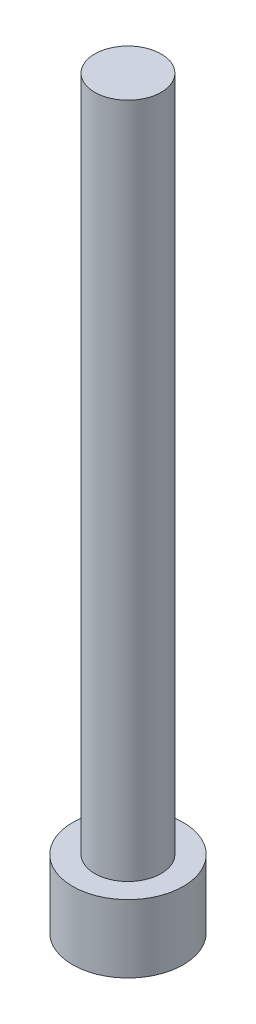
ISO-10303-21;
HEADER;
FILE_DESCRIPTION(('STEP AP214'),'2;1');
FILE_NAME('part.step','',(''),(''),'','','');
FILE_SCHEMA(('AUTOMOTIVE_DESIGN { 1 0 10303 214 1 1 1 1 }'));
ENDSEC;
DATA;
#1=APPLICATION_CONTEXT('core data for automotive mechanical design processes');
#2=APPLICATION_PROTOCOL_DEFINITION('international standard','automotive_design',2000,#1);
#3=PRODUCT_CONTEXT('',#1,'mechanical');
#4=PRODUCT('Part','Part','',(#3));
#5=PRODUCT_RELATED_PRODUCT_CATEGORY('part','',(#4));
#6=PRODUCT_DEFINITION_FORMATION('','',#4);
#7=PRODUCT_DEFINITION_CONTEXT('part definition',#1,'design');
#8=PRODUCT_DEFINITION('design','',#6,#7);
#9=PRODUCT_DEFINITION_SHAPE('','',#8);
#10=(LENGTH_UNIT() NAMED_UNIT(*) SI_UNIT(.MILLI.,.METRE.));
#11=(NAMED_UNIT(*) PLANE_ANGLE_UNIT() SI_UNIT($,.RADIAN.));
#12=(NAMED_UNIT(*) SI_UNIT($,.STERADIAN.) SOLID_ANGLE_UNIT());
#13=UNCERTAINTY_MEASURE_WITH_UNIT(LENGTH_MEASURE(1.E-05),#10,'distance_accuracy_value','');
#14=(GEOMETRIC_REPRESENTATION_CONTEXT(3) GLOBAL_UNCERTAINTY_ASSIGNED_CONTEXT((#13)) GLOBAL_UNIT_ASSIGNED_CONTEXT((#10,
#11,#12)) REPRESENTATION_CONTEXT('',''));
#15=CARTESIAN_POINT('',(0.,0.,0.));
#16=DIRECTION('',(0.,0.,1.));
#17=DIRECTION('',(1.,0.,0.));
#18=AXIS2_PLACEMENT_3D('',#15,#16,#17);
#19=CARTESIAN_POINT('',(0.,3.5052,0.));
#20=DIRECTION('',(0.,1.,0.));
#21=DIRECTION('',(0.,0.,1.));
#22=AXIS2_PLACEMENT_3D('',#19,#20,#21);
#23=PLANE('',#22);
#24=CARTESIAN_POINT('',(0.,3.5052,0.));
#25=DIRECTION('',(0.,1.,0.));
#26=DIRECTION('',(0.,0.,1.));
#27=AXIS2_PLACEMENT_3D('',#24,#25,#26);
#28=CIRCLE('',#27,2.8575);
#29=CARTESIAN_POINT('',(0.,3.5052,2.8575));
#30=VERTEX_POINT('',#29);
#31=EDGE_CURVE('E11',#30,#30,#28,.T.);
#32=ORIENTED_EDGE('',*,*,#31,.T.);
#33=EDGE_LOOP('',(#32));
#34=FACE_BOUND('',#33,.T.);
#35=CARTESIAN_POINT('',(0.,3.5052,0.));
#36=DIRECTION('',(0.,1.,0.));
#37=DIRECTION('',(0.,0.,1.));
#38=AXIS2_PLACEMENT_3D('',#35,#36,#37);
#39=CIRCLE('',#38,1.7145);
#40=CARTESIAN_POINT('',(0.,3.5052,1.7145));
#41=VERTEX_POINT('',#40);
#42=EDGE_CURVE('E152',#41,#41,#39,.T.);
#43=ORIENTED_EDGE('',*,*,#42,.F.);
#44=EDGE_LOOP('',(#43));
#45=FACE_BOUND('',#44,.T.);
#46=ADVANCED_FACE('F33',(#34,#45),#23,.T.);
#47=CARTESIAN_POINT('',(0.,3.5052,0.));
#48=DIRECTION('',(0.,-1.,0.));
#49=DIRECTION('',(0.,0.,-1.));
#50=AXIS2_PLACEMENT_3D('',#47,#48,#49);
#51=CYLINDRICAL_SURFACE('',#50,2.8575);
#52=ORIENTED_EDGE('',*,*,#31,.F.);
#53=EDGE_LOOP('',(#52));
#54=FACE_BOUND('',#53,.T.);
#55=CARTESIAN_POINT('',(0.,0.,0.));
#56=DIRECTION('',(0.,1.,0.));
#57=DIRECTION('',(0.,0.,1.));
#58=AXIS2_PLACEMENT_3D('',#55,#56,#57);
#59=CIRCLE('',#58,2.8575);
#60=CARTESIAN_POINT('',(0.,0.,2.8575));
#61=VERTEX_POINT('',#60);
#62=EDGE_CURVE('E37',#61,#61,#59,.T.);
#63=ORIENTED_EDGE('',*,*,#62,.T.);
#64=EDGE_LOOP('',(#63));
#65=FACE_BOUND('',#64,.T.);
#66=ADVANCED_FACE('F35',(#54,#65),#51,.T.);
#67=CARTESIAN_POINT('',(0.,0.,0.));
#68=DIRECTION('',(0.,1.,0.));
#69=DIRECTION('',(0.,0.,1.));
#70=AXIS2_PLACEMENT_3D('',#67,#68,#69);
#71=PLANE('',#70);
#72=DIRECTION('',(-0.500000000000001,0.,0.866025403784438));
#73=VECTOR('',#72,1.);
#74=CARTESIAN_POINT('',(1.60395121659243,0.,0.));
#75=LINE('',#74,#73);
#76=CARTESIAN_POINT('',(1.60395121659243,0.,0.));
#77=VERTEX_POINT('',#76);
#78=CARTESIAN_POINT('',(0.801975608296214,0.,1.3890625));
#79=VERTEX_POINT('',#78);
#80=EDGE_CURVE('E122',#77,#79,#75,.T.);
#81=ORIENTED_EDGE('',*,*,#80,.F.);
#82=DIRECTION('',(0.5,0.,0.866025403784439));
#83=VECTOR('',#82,1.);
#84=CARTESIAN_POINT('',(0.801975608296215,0.,-1.3890625));
#85=LINE('',#84,#83);
#86=CARTESIAN_POINT('',(0.801975608296215,0.,-1.3890625));
#87=VERTEX_POINT('',#86);
#88=EDGE_CURVE('E48',#87,#77,#85,.T.);
#89=ORIENTED_EDGE('',*,*,#88,.F.);
#90=DIRECTION('',(1.,0.,0.));
#91=VECTOR('',#90,1.);
#92=CARTESIAN_POINT('',(-0.801975608296214,0.,-1.3890625));
#93=LINE('',#92,#91);
#94=CARTESIAN_POINT('',(-0.801975608296214,0.,-1.3890625));
#95=VERTEX_POINT('',#94);
#96=EDGE_CURVE('E132',#95,#87,#93,.T.);
#97=ORIENTED_EDGE('',*,*,#96,.F.);
#98=DIRECTION('',(0.5,0.,-0.866025403784438));
#99=VECTOR('',#98,1.);
#100=CARTESIAN_POINT('',(-1.60395121659243,0.,0.));
#101=LINE('',#100,#99);
#102=CARTESIAN_POINT('',(-1.60395121659243,0.,0.));
#103=VERTEX_POINT('',#102);
#104=EDGE_CURVE('E130',#103,#95,#101,.T.);
#105=ORIENTED_EDGE('',*,*,#104,.F.);
#106=DIRECTION('',(-0.5,0.,-0.866025403784439));
#107=VECTOR('',#106,1.);
#108=CARTESIAN_POINT('',(-0.801975608296214,0.,1.3890625));
#109=LINE('',#108,#107);
#110=CARTESIAN_POINT('',(-0.801975608296214,0.,1.3890625));
#111=VERTEX_POINT('',#110);
#112=EDGE_CURVE('E96',#111,#103,#109,.T.);
#113=ORIENTED_EDGE('',*,*,#112,.F.);
#114=DIRECTION('',(-1.,0.,0.));
#115=VECTOR('',#114,1.);
#116=CARTESIAN_POINT('',(0.801975608296214,0.,1.3890625));
#117=LINE('',#116,#115);
#118=EDGE_CURVE('E126',#79,#111,#117,.T.);
#119=ORIENTED_EDGE('',*,*,#118,.F.);
#120=EDGE_LOOP('',(#81,#89,#97,#105,#113,#119));
#121=FACE_BOUND('',#120,.T.);
#122=ORIENTED_EDGE('',*,*,#62,.F.);
#123=EDGE_LOOP('',(#122));
#124=FACE_BOUND('',#123,.T.);
#125=ADVANCED_FACE('F145',(#121,#124),#71,.F.);
#126=CARTESIAN_POINT('',(0.801975608296215,1.9558,-1.3890625));
#127=DIRECTION('',(0.866025403784438,0.,-0.5));
#128=DIRECTION('',(-0.5,0.,-0.866025403784439));
#129=AXIS2_PLACEMENT_3D('',#126,#127,#128);
#130=PLANE('',#129);
#131=ORIENTED_EDGE('',*,*,#88,.T.);
#132=DIRECTION('',(0.,-1.,0.));
#133=VECTOR('',#132,1.);
#134=CARTESIAN_POINT('',(1.60395121659243,1.9558,0.));
#135=LINE('',#134,#133);
#136=CARTESIAN_POINT('',(1.60395121659243,1.9558,0.));
#137=VERTEX_POINT('',#136);
#138=EDGE_CURVE('E78',#137,#77,#135,.T.);
#139=ORIENTED_EDGE('',*,*,#138,.F.);
#140=DIRECTION('',(0.5,0.,0.866025403784439));
#141=VECTOR('',#140,1.);
#142=CARTESIAN_POINT('',(0.801975608296215,1.9558,-1.3890625));
#143=LINE('',#142,#141);
#144=CARTESIAN_POINT('',(0.801975608296215,1.9558,-1.3890625));
#145=VERTEX_POINT('',#144);
#146=EDGE_CURVE('E134',#145,#137,#143,.T.);
#147=ORIENTED_EDGE('',*,*,#146,.F.);
#148=DIRECTION('',(0.,-1.,0.));
#149=VECTOR('',#148,1.);
#150=CARTESIAN_POINT('',(0.801975608296215,1.9558,-1.3890625));
#151=LINE('',#150,#149);
#152=EDGE_CURVE('E56',#145,#87,#151,.T.);
#153=ORIENTED_EDGE('',*,*,#152,.T.);
#154=EDGE_LOOP('',(#131,#139,#147,#153));
#155=FACE_BOUND('',#154,.T.);
#156=ADVANCED_FACE('F174',(#155),#130,.F.);
#157=CARTESIAN_POINT('',(-0.801975608296214,1.9558,-1.3890625));
#158=DIRECTION('',(0.,0.,-1.));
#159=DIRECTION('',(-1.,0.,0.));
#160=AXIS2_PLACEMENT_3D('',#157,#158,#159);
#161=PLANE('',#160);
#162=ORIENTED_EDGE('',*,*,#96,.T.);
#163=ORIENTED_EDGE('',*,*,#152,.F.);
#164=DIRECTION('',(1.,0.,0.));
#165=VECTOR('',#164,1.);
#166=CARTESIAN_POINT('',(-0.801975608296214,1.9558,-1.3890625));
#167=LINE('',#166,#165);
#168=CARTESIAN_POINT('',(-0.801975608296214,1.9558,-1.3890625));
#169=VERTEX_POINT('',#168);
#170=EDGE_CURVE('E108',#169,#145,#167,.T.);
#171=ORIENTED_EDGE('',*,*,#170,.F.);
#172=DIRECTION('',(0.,-1.,0.));
#173=VECTOR('',#172,1.);
#174=CARTESIAN_POINT('',(-0.801975608296214,1.9558,-1.3890625));
#175=LINE('',#174,#173);
#176=EDGE_CURVE('E100',#169,#95,#175,.T.);
#177=ORIENTED_EDGE('',*,*,#176,.T.);
#178=EDGE_LOOP('',(#162,#163,#171,#177));
#179=FACE_BOUND('',#178,.T.);
#180=ADVANCED_FACE('F180',(#179),#161,.F.);
#181=CARTESIAN_POINT('',(-1.60395121659243,1.9558,0.));
#182=DIRECTION('',(-0.866025403784438,0.,-0.5));
#183=DIRECTION('',(-0.5,0.,0.866025403784439));
#184=AXIS2_PLACEMENT_3D('',#181,#182,#183);
#185=PLANE('',#184);
#186=ORIENTED_EDGE('',*,*,#104,.T.);
#187=ORIENTED_EDGE('',*,*,#176,.F.);
#188=DIRECTION('',(0.5,0.,-0.866025403784438));
#189=VECTOR('',#188,1.);
#190=CARTESIAN_POINT('',(-1.60395121659243,1.9558,0.));
#191=LINE('',#190,#189);
#192=CARTESIAN_POINT('',(-1.60395121659243,1.9558,0.));
#193=VERTEX_POINT('',#192);
#194=EDGE_CURVE('E104',#193,#169,#191,.T.);
#195=ORIENTED_EDGE('',*,*,#194,.F.);
#196=DIRECTION('',(0.,-1.,0.));
#197=VECTOR('',#196,1.);
#198=CARTESIAN_POINT('',(-1.60395121659243,1.9558,0.));
#199=LINE('',#198,#197);
#200=EDGE_CURVE('E89',#193,#103,#199,.T.);
#201=ORIENTED_EDGE('',*,*,#200,.T.);
#202=EDGE_LOOP('',(#186,#187,#195,#201));
#203=FACE_BOUND('',#202,.T.);
#204=ADVANCED_FACE('F105',(#203),#185,.F.);
#205=CARTESIAN_POINT('',(-0.801975608296214,1.9558,1.3890625));
#206=DIRECTION('',(-0.866025403784439,0.,0.5));
#207=DIRECTION('',(0.5,0.,0.866025403784439));
#208=AXIS2_PLACEMENT_3D('',#205,#206,#207);
#209=PLANE('',#208);
#210=ORIENTED_EDGE('',*,*,#112,.T.);
#211=ORIENTED_EDGE('',*,*,#200,.F.);
#212=DIRECTION('',(-0.5,0.,-0.866025403784439));
#213=VECTOR('',#212,1.);
#214=CARTESIAN_POINT('',(-0.801975608296214,1.9558,1.3890625));
#215=LINE('',#214,#213);
#216=CARTESIAN_POINT('',(-0.801975608296214,1.9558,1.3890625));
#217=VERTEX_POINT('',#216);
#218=EDGE_CURVE('E93',#217,#193,#215,.T.);
#219=ORIENTED_EDGE('',*,*,#218,.F.);
#220=DIRECTION('',(0.,-1.,0.));
#221=VECTOR('',#220,1.);
#222=CARTESIAN_POINT('',(-0.801975608296214,1.9558,1.3890625));
#223=LINE('',#222,#221);
#224=EDGE_CURVE('E101',#217,#111,#223,.T.);
#225=ORIENTED_EDGE('',*,*,#224,.T.);
#226=EDGE_LOOP('',(#210,#211,#219,#225));
#227=FACE_BOUND('',#226,.T.);
#228=ADVANCED_FACE('F91',(#227),#209,.F.);
#229=CARTESIAN_POINT('',(0.801975608296214,1.9558,1.3890625));
#230=DIRECTION('',(0.,0.,1.));
#231=DIRECTION('',(1.,0.,0.));
#232=AXIS2_PLACEMENT_3D('',#229,#230,#231);
#233=PLANE('',#232);
#234=ORIENTED_EDGE('',*,*,#118,.T.);
#235=ORIENTED_EDGE('',*,*,#224,.F.);
#236=DIRECTION('',(-1.,0.,0.));
#237=VECTOR('',#236,1.);
#238=CARTESIAN_POINT('',(0.801975608296214,1.9558,1.3890625));
#239=LINE('',#238,#237);
#240=CARTESIAN_POINT('',(0.801975608296214,1.9558,1.3890625));
#241=VERTEX_POINT('',#240);
#242=EDGE_CURVE('E114',#241,#217,#239,.T.);
#243=ORIENTED_EDGE('',*,*,#242,.F.);
#244=DIRECTION('',(0.,-1.,0.));
#245=VECTOR('',#244,1.);
#246=CARTESIAN_POINT('',(0.801975608296214,1.9558,1.3890625));
#247=LINE('',#246,#245);
#248=EDGE_CURVE('E138',#241,#79,#247,.T.);
#249=ORIENTED_EDGE('',*,*,#248,.T.);
#250=EDGE_LOOP('',(#234,#235,#243,#249));
#251=FACE_BOUND('',#250,.T.);
#252=ADVANCED_FACE('F149',(#251),#233,.F.);
#253=CARTESIAN_POINT('',(1.60395121659243,1.9558,0.));
#254=DIRECTION('',(0.866025403784438,0.,0.500000000000001));
#255=DIRECTION('',(0.500000000000001,0.,-0.866025403784438));
#256=AXIS2_PLACEMENT_3D('',#253,#254,#255);
#257=PLANE('',#256);
#258=ORIENTED_EDGE('',*,*,#80,.T.);
#259=ORIENTED_EDGE('',*,*,#248,.F.);
#260=DIRECTION('',(-0.500000000000001,0.,0.866025403784438));
#261=VECTOR('',#260,1.);
#262=CARTESIAN_POINT('',(1.60395121659243,1.9558,0.));
#263=LINE('',#262,#261);
#264=EDGE_CURVE('E116',#137,#241,#263,.T.);
#265=ORIENTED_EDGE('',*,*,#264,.F.);
#266=ORIENTED_EDGE('',*,*,#138,.T.);
#267=EDGE_LOOP('',(#258,#259,#265,#266));
#268=FACE_BOUND('',#267,.T.);
#269=ADVANCED_FACE('F142',(#268),#257,.F.);
#270=CARTESIAN_POINT('',(0.,1.9558,0.));
#271=DIRECTION('',(0.,-1.,0.));
#272=DIRECTION('',(0.,0.,-1.));
#273=AXIS2_PLACEMENT_3D('',#270,#271,#272);
#274=PLANE('',#273);
#275=ORIENTED_EDGE('',*,*,#146,.T.);
#276=ORIENTED_EDGE('',*,*,#264,.T.);
#277=ORIENTED_EDGE('',*,*,#242,.T.);
#278=ORIENTED_EDGE('',*,*,#218,.T.);
#279=ORIENTED_EDGE('',*,*,#194,.T.);
#280=ORIENTED_EDGE('',*,*,#170,.T.);
#281=EDGE_LOOP('',(#275,#276,#277,#278,#279,#280));
#282=FACE_BOUND('',#281,.T.);
#283=ADVANCED_FACE('F111',(#282),#274,.T.);
#284=CARTESIAN_POINT('',(0.,38.4302,0.));
#285=DIRECTION('',(0.,-1.,0.));
#286=DIRECTION('',(0.,0.,-1.));
#287=AXIS2_PLACEMENT_3D('',#284,#285,#286);
#288=CYLINDRICAL_SURFACE('',#287,1.7145);
#289=CARTESIAN_POINT('',(0.,38.4302,0.));
#290=DIRECTION('',(0.,1.,0.));
#291=DIRECTION('',(0.,0.,1.));
#292=AXIS2_PLACEMENT_3D('',#289,#290,#291);
#293=CIRCLE('',#292,1.7145);
#294=CARTESIAN_POINT('',(0.,38.4302,1.7145));
#295=VERTEX_POINT('',#294);
#296=EDGE_CURVE('E123',#295,#295,#293,.T.);
#297=ORIENTED_EDGE('',*,*,#296,.F.);
#298=EDGE_LOOP('',(#297));
#299=FACE_BOUND('',#298,.T.);
#300=ORIENTED_EDGE('',*,*,#42,.T.);
#301=EDGE_LOOP('',(#300));
#302=FACE_BOUND('',#301,.T.);
#303=ADVANCED_FACE('F160',(#299,#302),#288,.T.);
#304=CARTESIAN_POINT('',(0.,38.4302,0.));
#305=DIRECTION('',(0.,1.,0.));
#306=DIRECTION('',(0.,0.,1.));
#307=AXIS2_PLACEMENT_3D('',#304,#305,#306);
#308=PLANE('',#307);
#309=ORIENTED_EDGE('',*,*,#296,.T.);
#310=EDGE_LOOP('',(#309));
#311=FACE_BOUND('',#310,.T.);
#312=ADVANCED_FACE('F158',(#311),#308,.T.);
#313=CLOSED_SHELL('',(#46,#66,#125,#156,#180,#204,#228,#252,#269,#283,#303,#312));
#314=MANIFOLD_SOLID_BREP('B2',#313);
#315=ADVANCED_BREP_SHAPE_REPRESENTATION('',(#18,#314),#14);
#316=SHAPE_DEFINITION_REPRESENTATION(#9,#315);
ENDSEC;
END-ISO-10303-21;
